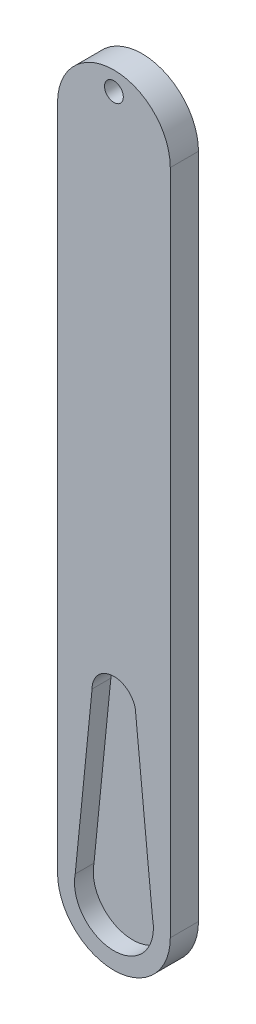
ISO-10303-21;
HEADER;
FILE_DESCRIPTION(('STEP AP214'),'2;1');
FILE_NAME('part.step','',(''),(''),'','','');
FILE_SCHEMA(('AUTOMOTIVE_DESIGN { 1 0 10303 214 1 1 1 1 }'));
ENDSEC;
DATA;
#1=APPLICATION_CONTEXT('core data for automotive mechanical design processes');
#2=APPLICATION_PROTOCOL_DEFINITION('international standard','automotive_design',2000,#1);
#3=PRODUCT_CONTEXT('',#1,'mechanical');
#4=PRODUCT('Part','Part','',(#3));
#5=PRODUCT_RELATED_PRODUCT_CATEGORY('part','',(#4));
#6=PRODUCT_DEFINITION_FORMATION('','',#4);
#7=PRODUCT_DEFINITION_CONTEXT('part definition',#1,'design');
#8=PRODUCT_DEFINITION('design','',#6,#7);
#9=PRODUCT_DEFINITION_SHAPE('','',#8);
#10=(LENGTH_UNIT() NAMED_UNIT(*) SI_UNIT(.MILLI.,.METRE.));
#11=(NAMED_UNIT(*) PLANE_ANGLE_UNIT() SI_UNIT($,.RADIAN.));
#12=(NAMED_UNIT(*) SI_UNIT($,.STERADIAN.) SOLID_ANGLE_UNIT());
#13=UNCERTAINTY_MEASURE_WITH_UNIT(LENGTH_MEASURE(1.E-05),#10,'distance_accuracy_value','');
#14=(GEOMETRIC_REPRESENTATION_CONTEXT(3) GLOBAL_UNCERTAINTY_ASSIGNED_CONTEXT((#13)) GLOBAL_UNIT_ASSIGNED_CONTEXT((#10,
#11,#12)) REPRESENTATION_CONTEXT('',''));
#15=CARTESIAN_POINT('',(0.,0.,0.));
#16=DIRECTION('',(0.,0.,1.));
#17=DIRECTION('',(1.,0.,0.));
#18=AXIS2_PLACEMENT_3D('',#15,#16,#17);
#19=CARTESIAN_POINT('',(0.,0.,3.));
#20=DIRECTION('',(0.,0.,1.));
#21=DIRECTION('',(1.,0.,0.));
#22=AXIS2_PLACEMENT_3D('',#19,#20,#21);
#23=PLANE('',#22);
#24=CARTESIAN_POINT('',(6.,81.,3.));
#25=DIRECTION('',(0.,0.,1.));
#26=DIRECTION('',(1.,0.,0.));
#27=AXIS2_PLACEMENT_3D('',#24,#25,#26);
#28=CIRCLE('',#27,1.);
#29=CARTESIAN_POINT('',(7.,81.,3.));
#30=VERTEX_POINT('',#29);
#31=EDGE_CURVE('E333',#30,#30,#28,.T.);
#32=ORIENTED_EDGE('',*,*,#31,.F.);
#33=EDGE_LOOP('',(#32));
#34=FACE_BOUND('',#33,.T.);
#35=CARTESIAN_POINT('',(6.,24.775,3.));
#36=DIRECTION('',(0.,0.,1.));
#37=DIRECTION('',(1.,0.,0.));
#38=AXIS2_PLACEMENT_3D('',#35,#36,#37);
#39=CIRCLE('',#38,2.325);
#40=CARTESIAN_POINT('',(8.325,24.775,3.));
#41=VERTEX_POINT('',#40);
#42=CARTESIAN_POINT('',(3.675,24.775,3.));
#43=VERTEX_POINT('',#42);
#44=EDGE_CURVE('E173',#41,#43,#39,.T.);
#45=ORIENTED_EDGE('',*,*,#44,.F.);
#46=DIRECTION('',(0.0993725332937997,-0.995050300048582,0.));
#47=VECTOR('',#46,1.);
#48=CARTESIAN_POINT('',(10.6925600306166,1.06783222675931,3.));
#49=LINE('',#48,#47);
#50=CARTESIAN_POINT('',(10.1170508368649,6.83059762019289,3.));
#51=VERTEX_POINT('',#50);
#52=EDGE_CURVE('E177',#41,#51,#49,.T.);
#53=ORIENTED_EDGE('',*,*,#52,.T.);
#54=CARTESIAN_POINT('',(6.,6.,3.));
#55=DIRECTION('',(0.,0.,1.));
#56=DIRECTION('',(1.,0.,0.));
#57=AXIS2_PLACEMENT_3D('',#54,#55,#56);
#58=CIRCLE('',#57,4.2);
#59=CARTESIAN_POINT('',(1.88294916313511,6.8305976201929,3.));
#60=VERTEX_POINT('',#59);
#61=EDGE_CURVE('E205',#60,#51,#58,.T.);
#62=ORIENTED_EDGE('',*,*,#61,.F.);
#63=DIRECTION('',(-0.0993725332937998,-0.995050300048582,0.));
#64=VECTOR('',#63,1.);
#65=CARTESIAN_POINT('',(1.18894116490469,-0.118735802087685,3.));
#66=LINE('',#65,#64);
#67=EDGE_CURVE('E207',#43,#60,#66,.T.);
#68=ORIENTED_EDGE('',*,*,#67,.F.);
#69=EDGE_LOOP('',(#45,#53,#62,#68));
#70=FACE_BOUND('',#69,.T.);
#71=DIRECTION('',(0.,1.,0.));
#72=VECTOR('',#71,1.);
#73=CARTESIAN_POINT('',(12.,0.,3.));
#74=LINE('',#73,#72);
#75=CARTESIAN_POINT('',(12.,6.,3.));
#76=VERTEX_POINT('',#75);
#77=CARTESIAN_POINT('',(12.,77.,3.));
#78=VERTEX_POINT('',#77);
#79=EDGE_CURVE('E186',#76,#78,#74,.T.);
#80=ORIENTED_EDGE('',*,*,#79,.T.);
#81=CARTESIAN_POINT('',(6.,77.,3.));
#82=DIRECTION('',(0.,0.,1.));
#83=DIRECTION('',(1.,0.,0.));
#84=AXIS2_PLACEMENT_3D('',#81,#82,#83);
#85=CIRCLE('',#84,6.00000000000001);
#86=CARTESIAN_POINT('',(0.,77.,3.));
#87=VERTEX_POINT('',#86);
#88=EDGE_CURVE('E160',#78,#87,#85,.T.);
#89=ORIENTED_EDGE('',*,*,#88,.T.);
#90=DIRECTION('',(0.,1.,0.));
#91=VECTOR('',#90,1.);
#92=CARTESIAN_POINT('',(0.,0.,3.));
#93=LINE('',#92,#91);
#94=CARTESIAN_POINT('',(0.,6.,3.));
#95=VERTEX_POINT('',#94);
#96=EDGE_CURVE('E210',#95,#87,#93,.T.);
#97=ORIENTED_EDGE('',*,*,#96,.F.);
#98=CARTESIAN_POINT('',(6.,6.,3.));
#99=DIRECTION('',(0.,0.,1.));
#100=DIRECTION('',(1.,0.,0.));
#101=AXIS2_PLACEMENT_3D('',#98,#99,#100);
#102=CIRCLE('',#101,6.);
#103=EDGE_CURVE('E213',#95,#76,#102,.T.);
#104=ORIENTED_EDGE('',*,*,#103,.T.);
#105=EDGE_LOOP('',(#80,#89,#97,#104));
#106=FACE_BOUND('',#105,.T.);
#107=ADVANCED_FACE('F81',(#34,#70,#106),#23,.T.);
#108=CARTESIAN_POINT('',(0.,0.,0.));
#109=DIRECTION('',(0.,0.,1.));
#110=DIRECTION('',(1.,0.,0.));
#111=AXIS2_PLACEMENT_3D('',#108,#109,#110);
#112=PLANE('',#111);
#113=CARTESIAN_POINT('',(6.,81.,0.));
#114=DIRECTION('',(0.,0.,1.));
#115=DIRECTION('',(1.,0.,0.));
#116=AXIS2_PLACEMENT_3D('',#113,#114,#115);
#117=CIRCLE('',#116,1.);
#118=CARTESIAN_POINT('',(7.,81.,0.));
#119=VERTEX_POINT('',#118);
#120=EDGE_CURVE('E168',#119,#119,#117,.T.);
#121=ORIENTED_EDGE('',*,*,#120,.T.);
#122=EDGE_LOOP('',(#121));
#123=FACE_BOUND('',#122,.T.);
#124=CARTESIAN_POINT('',(6.,77.,0.));
#125=DIRECTION('',(0.,0.,1.));
#126=DIRECTION('',(1.,0.,0.));
#127=AXIS2_PLACEMENT_3D('',#124,#125,#126);
#128=CIRCLE('',#127,6.00000000000001);
#129=CARTESIAN_POINT('',(12.,77.,0.));
#130=VERTEX_POINT('',#129);
#131=CARTESIAN_POINT('',(0.,77.,0.));
#132=VERTEX_POINT('',#131);
#133=EDGE_CURVE('E148',#130,#132,#128,.T.);
#134=ORIENTED_EDGE('',*,*,#133,.F.);
#135=DIRECTION('',(0.,1.,0.));
#136=VECTOR('',#135,1.);
#137=CARTESIAN_POINT('',(12.,0.,0.));
#138=LINE('',#137,#136);
#139=CARTESIAN_POINT('',(12.,6.,0.));
#140=VERTEX_POINT('',#139);
#141=EDGE_CURVE('E153',#140,#130,#138,.T.);
#142=ORIENTED_EDGE('',*,*,#141,.F.);
#143=CARTESIAN_POINT('',(6.,6.,0.));
#144=DIRECTION('',(0.,0.,1.));
#145=DIRECTION('',(1.,0.,0.));
#146=AXIS2_PLACEMENT_3D('',#143,#144,#145);
#147=CIRCLE('',#146,6.);
#148=CARTESIAN_POINT('',(0.,6.,0.));
#149=VERTEX_POINT('',#148);
#150=EDGE_CURVE('E174',#149,#140,#147,.T.);
#151=ORIENTED_EDGE('',*,*,#150,.F.);
#152=DIRECTION('',(0.,1.,0.));
#153=VECTOR('',#152,1.);
#154=CARTESIAN_POINT('',(0.,0.,0.));
#155=LINE('',#154,#153);
#156=EDGE_CURVE('E156',#149,#132,#155,.T.);
#157=ORIENTED_EDGE('',*,*,#156,.T.);
#158=EDGE_LOOP('',(#134,#142,#151,#157));
#159=FACE_BOUND('',#158,.T.);
#160=ADVANCED_FACE('F150',(#123,#159),#112,.F.);
#161=CARTESIAN_POINT('',(0.,0.,3.));
#162=DIRECTION('',(-1.,0.,0.));
#163=DIRECTION('',(0.,0.,1.));
#164=AXIS2_PLACEMENT_3D('',#161,#162,#163);
#165=PLANE('',#164);
#166=DIRECTION('',(0.,0.,1.));
#167=VECTOR('',#166,1.);
#168=CARTESIAN_POINT('',(0.,77.,0.));
#169=LINE('',#168,#167);
#170=EDGE_CURVE('E159',#132,#87,#169,.T.);
#171=ORIENTED_EDGE('',*,*,#170,.F.);
#172=ORIENTED_EDGE('',*,*,#156,.F.);
#173=DIRECTION('',(0.,0.,-1.));
#174=VECTOR('',#173,1.);
#175=CARTESIAN_POINT('',(0.,6.,3.));
#176=LINE('',#175,#174);
#177=EDGE_CURVE('E12',#95,#149,#176,.T.);
#178=ORIENTED_EDGE('',*,*,#177,.F.);
#179=ORIENTED_EDGE('',*,*,#96,.T.);
#180=EDGE_LOOP('',(#171,#172,#178,#179));
#181=FACE_BOUND('',#180,.T.);
#182=ADVANCED_FACE('F222',(#181),#165,.T.);
#183=CARTESIAN_POINT('',(6.,6.,3.));
#184=DIRECTION('',(0.,0.,-1.));
#185=DIRECTION('',(-1.,0.,0.));
#186=AXIS2_PLACEMENT_3D('',#183,#184,#185);
#187=CYLINDRICAL_SURFACE('',#186,6.);
#188=ORIENTED_EDGE('',*,*,#150,.T.);
#189=DIRECTION('',(0.,0.,-1.));
#190=VECTOR('',#189,1.);
#191=CARTESIAN_POINT('',(12.,6.,3.));
#192=LINE('',#191,#190);
#193=EDGE_CURVE('E90',#76,#140,#192,.T.);
#194=ORIENTED_EDGE('',*,*,#193,.F.);
#195=ORIENTED_EDGE('',*,*,#103,.F.);
#196=ORIENTED_EDGE('',*,*,#177,.T.);
#197=EDGE_LOOP('',(#188,#194,#195,#196));
#198=FACE_BOUND('',#197,.T.);
#199=ADVANCED_FACE('F220',(#198),#187,.T.);
#200=CARTESIAN_POINT('',(12.,0.,3.));
#201=DIRECTION('',(-1.,0.,0.));
#202=DIRECTION('',(0.,-1.,0.));
#203=AXIS2_PLACEMENT_3D('',#200,#201,#202);
#204=PLANE('',#203);
#205=ORIENTED_EDGE('',*,*,#141,.T.);
#206=DIRECTION('',(0.,0.,1.));
#207=VECTOR('',#206,1.);
#208=CARTESIAN_POINT('',(12.,77.,0.));
#209=LINE('',#208,#207);
#210=EDGE_CURVE('E163',#130,#78,#209,.T.);
#211=ORIENTED_EDGE('',*,*,#210,.T.);
#212=ORIENTED_EDGE('',*,*,#79,.F.);
#213=ORIENTED_EDGE('',*,*,#193,.T.);
#214=EDGE_LOOP('',(#205,#211,#212,#213));
#215=FACE_BOUND('',#214,.T.);
#216=ADVANCED_FACE('F170',(#215),#204,.F.);
#217=CARTESIAN_POINT('',(6.,24.775,3.));
#218=DIRECTION('',(0.,0.,-1.));
#219=DIRECTION('',(-1.,0.,0.));
#220=AXIS2_PLACEMENT_3D('',#217,#218,#219);
#221=CYLINDRICAL_SURFACE('',#220,2.325);
#222=CARTESIAN_POINT('',(6.,24.775,1.));
#223=DIRECTION('',(0.,0.,1.));
#224=DIRECTION('',(1.,0.,0.));
#225=AXIS2_PLACEMENT_3D('',#222,#223,#224);
#226=CIRCLE('',#225,2.325);
#227=CARTESIAN_POINT('',(8.325,24.775,1.));
#228=VERTEX_POINT('',#227);
#229=CARTESIAN_POINT('',(3.675,24.775,1.));
#230=VERTEX_POINT('',#229);
#231=EDGE_CURVE('E98',#228,#230,#226,.T.);
#232=ORIENTED_EDGE('',*,*,#231,.F.);
#233=DIRECTION('',(0.,0.,-1.));
#234=VECTOR('',#233,1.);
#235=CARTESIAN_POINT('',(8.325,24.775,3.));
#236=LINE('',#235,#234);
#237=EDGE_CURVE('E85',#41,#228,#236,.T.);
#238=ORIENTED_EDGE('',*,*,#237,.F.);
#239=ORIENTED_EDGE('',*,*,#44,.T.);
#240=DIRECTION('',(0.,0.,-1.));
#241=VECTOR('',#240,1.);
#242=CARTESIAN_POINT('',(3.675,24.775,3.));
#243=LINE('',#242,#241);
#244=EDGE_CURVE('E183',#43,#230,#243,.T.);
#245=ORIENTED_EDGE('',*,*,#244,.T.);
#246=EDGE_LOOP('',(#232,#238,#239,#245));
#247=FACE_BOUND('',#246,.T.);
#248=ADVANCED_FACE('F83',(#247),#221,.F.);
#249=CARTESIAN_POINT('',(10.6925600306166,1.06783222675931,3.));
#250=DIRECTION('',(0.995050300048582,0.0993725332937997,0.));
#251=DIRECTION('',(-0.0993725332937997,0.995050300048582,0.));
#252=AXIS2_PLACEMENT_3D('',#249,#250,#251);
#253=PLANE('',#252);
#254=ORIENTED_EDGE('',*,*,#237,.T.);
#255=DIRECTION('',(0.0993725332937997,-0.995050300048582,0.));
#256=VECTOR('',#255,1.);
#257=CARTESIAN_POINT('',(10.6925600306166,1.06783222675931,1.));
#258=LINE('',#257,#256);
#259=CARTESIAN_POINT('',(10.1170508368649,6.83059762019289,1.));
#260=VERTEX_POINT('',#259);
#261=EDGE_CURVE('E105',#228,#260,#258,.T.);
#262=ORIENTED_EDGE('',*,*,#261,.T.);
#263=DIRECTION('',(0.,0.,-1.));
#264=VECTOR('',#263,1.);
#265=CARTESIAN_POINT('',(10.1170508368649,6.83059762019289,3.));
#266=LINE('',#265,#264);
#267=EDGE_CURVE('E187',#51,#260,#266,.T.);
#268=ORIENTED_EDGE('',*,*,#267,.F.);
#269=ORIENTED_EDGE('',*,*,#52,.F.);
#270=EDGE_LOOP('',(#254,#262,#268,#269));
#271=FACE_BOUND('',#270,.T.);
#272=ADVANCED_FACE('F193',(#271),#253,.F.);
#273=CARTESIAN_POINT('',(6.,6.,3.));
#274=DIRECTION('',(0.,0.,-1.));
#275=DIRECTION('',(-1.,0.,0.));
#276=AXIS2_PLACEMENT_3D('',#273,#274,#275);
#277=CYLINDRICAL_SURFACE('',#276,4.2);
#278=CARTESIAN_POINT('',(6.,6.,1.));
#279=DIRECTION('',(0.,0.,1.));
#280=DIRECTION('',(1.,0.,0.));
#281=AXIS2_PLACEMENT_3D('',#278,#279,#280);
#282=CIRCLE('',#281,4.2);
#283=CARTESIAN_POINT('',(1.88294916313511,6.8305976201929,1.));
#284=VERTEX_POINT('',#283);
#285=EDGE_CURVE('E198',#284,#260,#282,.T.);
#286=ORIENTED_EDGE('',*,*,#285,.F.);
#287=DIRECTION('',(0.,0.,-1.));
#288=VECTOR('',#287,1.);
#289=CARTESIAN_POINT('',(1.88294916313511,6.8305976201929,3.));
#290=LINE('',#289,#288);
#291=EDGE_CURVE('E185',#60,#284,#290,.T.);
#292=ORIENTED_EDGE('',*,*,#291,.F.);
#293=ORIENTED_EDGE('',*,*,#61,.T.);
#294=ORIENTED_EDGE('',*,*,#267,.T.);
#295=EDGE_LOOP('',(#286,#292,#293,#294));
#296=FACE_BOUND('',#295,.T.);
#297=ADVANCED_FACE('F231',(#296),#277,.F.);
#298=CARTESIAN_POINT('',(1.18894116490469,-0.118735802087685,3.));
#299=DIRECTION('',(0.995050300048582,-0.0993725332937998,0.));
#300=DIRECTION('',(0.0993725332937998,0.995050300048582,0.));
#301=AXIS2_PLACEMENT_3D('',#298,#299,#300);
#302=PLANE('',#301);
#303=DIRECTION('',(-0.0993725332937998,-0.995050300048582,0.));
#304=VECTOR('',#303,1.);
#305=CARTESIAN_POINT('',(1.18894116490469,-0.118735802087685,1.));
#306=LINE('',#305,#304);
#307=EDGE_CURVE('E200',#230,#284,#306,.T.);
#308=ORIENTED_EDGE('',*,*,#307,.F.);
#309=ORIENTED_EDGE('',*,*,#244,.F.);
#310=ORIENTED_EDGE('',*,*,#67,.T.);
#311=ORIENTED_EDGE('',*,*,#291,.T.);
#312=EDGE_LOOP('',(#308,#309,#310,#311));
#313=FACE_BOUND('',#312,.T.);
#314=ADVANCED_FACE('F227',(#313),#302,.T.);
#315=CARTESIAN_POINT('',(0.,0.,1.));
#316=DIRECTION('',(0.,0.,1.));
#317=DIRECTION('',(1.,0.,0.));
#318=AXIS2_PLACEMENT_3D('',#315,#316,#317);
#319=PLANE('',#318);
#320=ORIENTED_EDGE('',*,*,#231,.T.);
#321=ORIENTED_EDGE('',*,*,#307,.T.);
#322=ORIENTED_EDGE('',*,*,#285,.T.);
#323=ORIENTED_EDGE('',*,*,#261,.F.);
#324=EDGE_LOOP('',(#320,#321,#322,#323));
#325=FACE_BOUND('',#324,.T.);
#326=ADVANCED_FACE('F196',(#325),#319,.T.);
#327=CARTESIAN_POINT('',(6.,77.,0.));
#328=DIRECTION('',(0.,0.,1.));
#329=DIRECTION('',(1.,0.,0.));
#330=AXIS2_PLACEMENT_3D('',#327,#328,#329);
#331=CYLINDRICAL_SURFACE('',#330,6.00000000000001);
#332=ORIENTED_EDGE('',*,*,#88,.F.);
#333=ORIENTED_EDGE('',*,*,#210,.F.);
#334=ORIENTED_EDGE('',*,*,#133,.T.);
#335=ORIENTED_EDGE('',*,*,#170,.T.);
#336=EDGE_LOOP('',(#332,#333,#334,#335));
#337=FACE_BOUND('',#336,.T.);
#338=ADVANCED_FACE('F164',(#337),#331,.T.);
#339=CARTESIAN_POINT('',(6.,81.,0.));
#340=DIRECTION('',(0.,0.,1.));
#341=DIRECTION('',(1.,0.,0.));
#342=AXIS2_PLACEMENT_3D('',#339,#340,#341);
#343=CYLINDRICAL_SURFACE('',#342,1.);
#344=ORIENTED_EDGE('',*,*,#120,.F.);
#345=EDGE_LOOP('',(#344));
#346=FACE_BOUND('',#345,.T.);
#347=ORIENTED_EDGE('',*,*,#31,.T.);
#348=EDGE_LOOP('',(#347));
#349=FACE_BOUND('',#348,.T.);
#350=ADVANCED_FACE('F315',(#346,#349),#343,.F.);
#351=CLOSED_SHELL('',(#107,#160,#182,#199,#216,#248,#272,#297,#314,#326,#338,#350));
#352=MANIFOLD_SOLID_BREP('B2',#351);
#353=ADVANCED_BREP_SHAPE_REPRESENTATION('',(#18,#352),#14);
#354=SHAPE_DEFINITION_REPRESENTATION(#9,#353);
ENDSEC;
END-ISO-10303-21;
